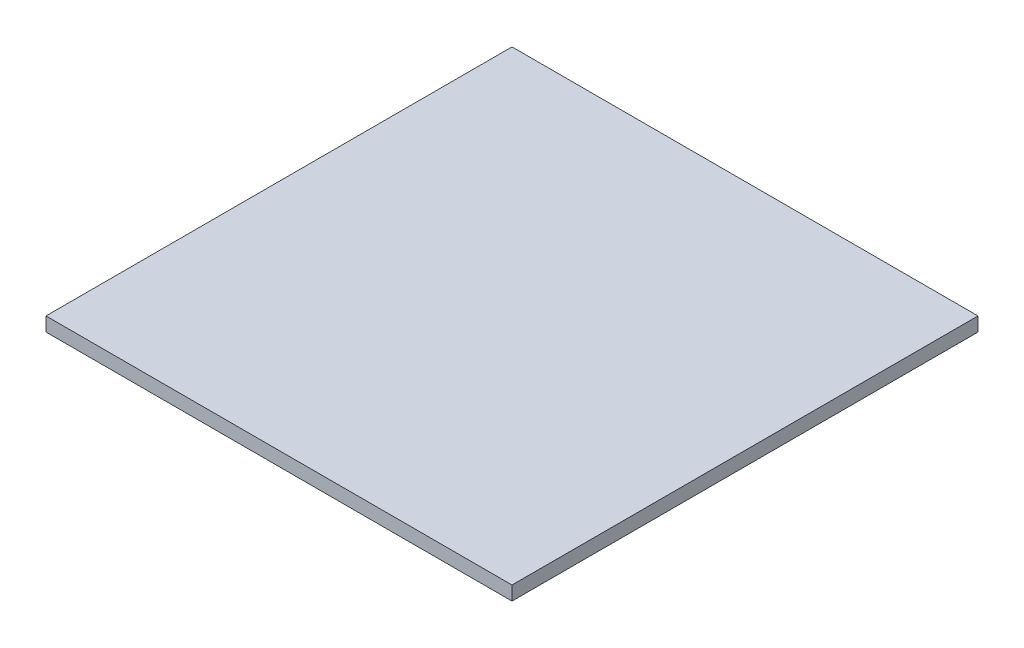
ISO-10303-21;
HEADER;
FILE_DESCRIPTION(('STEP AP214'),'2;1');
FILE_NAME('part.step','',(''),(''),'','','');
FILE_SCHEMA(('AUTOMOTIVE_DESIGN { 1 0 10303 214 1 1 1 1 }'));
ENDSEC;
DATA;
#1=APPLICATION_CONTEXT('core data for automotive mechanical design processes');
#2=APPLICATION_PROTOCOL_DEFINITION('international standard','automotive_design',2000,#1);
#3=PRODUCT_CONTEXT('',#1,'mechanical');
#4=PRODUCT('Part','Part','',(#3));
#5=PRODUCT_RELATED_PRODUCT_CATEGORY('part','',(#4));
#6=PRODUCT_DEFINITION_FORMATION('','',#4);
#7=PRODUCT_DEFINITION_CONTEXT('part definition',#1,'design');
#8=PRODUCT_DEFINITION('design','',#6,#7);
#9=PRODUCT_DEFINITION_SHAPE('','',#8);
#10=(LENGTH_UNIT() NAMED_UNIT(*) SI_UNIT(.MILLI.,.METRE.));
#11=(NAMED_UNIT(*) PLANE_ANGLE_UNIT() SI_UNIT($,.RADIAN.));
#12=(NAMED_UNIT(*) SI_UNIT($,.STERADIAN.) SOLID_ANGLE_UNIT());
#13=UNCERTAINTY_MEASURE_WITH_UNIT(LENGTH_MEASURE(1.E-05),#10,'distance_accuracy_value','');
#14=(GEOMETRIC_REPRESENTATION_CONTEXT(3) GLOBAL_UNCERTAINTY_ASSIGNED_CONTEXT((#13)) GLOBAL_UNIT_ASSIGNED_CONTEXT((#10,
#11,#12)) REPRESENTATION_CONTEXT('',''));
#15=CARTESIAN_POINT('',(0.,0.,0.));
#16=DIRECTION('',(0.,0.,1.));
#17=DIRECTION('',(1.,0.,0.));
#18=AXIS2_PLACEMENT_3D('',#15,#16,#17);
#19=CARTESIAN_POINT('',(0.,6.,0.));
#20=DIRECTION('',(0.,0.,-1.));
#21=DIRECTION('',(-1.,0.,0.));
#22=AXIS2_PLACEMENT_3D('',#19,#20,#21);
#23=PLANE('',#22);
#24=DIRECTION('',(1.,0.,0.));
#25=VECTOR('',#24,1.);
#26=CARTESIAN_POINT('',(0.,0.,0.));
#27=LINE('',#26,#25);
#28=CARTESIAN_POINT('',(0.,0.,0.));
#29=VERTEX_POINT('',#28);
#30=CARTESIAN_POINT('',(200.,0.,0.));
#31=VERTEX_POINT('',#30);
#32=EDGE_CURVE('E107',#29,#31,#27,.T.);
#33=ORIENTED_EDGE('',*,*,#32,.T.);
#34=DIRECTION('',(0.,-1.,0.));
#35=VECTOR('',#34,1.);
#36=CARTESIAN_POINT('',(200.,6.,0.));
#37=LINE('',#36,#35);
#38=CARTESIAN_POINT('',(200.,6.,0.));
#39=VERTEX_POINT('',#38);
#40=EDGE_CURVE('E11',#39,#31,#37,.T.);
#41=ORIENTED_EDGE('',*,*,#40,.F.);
#42=DIRECTION('',(1.,0.,0.));
#43=VECTOR('',#42,1.);
#44=CARTESIAN_POINT('',(0.,6.,0.));
#45=LINE('',#44,#43);
#46=CARTESIAN_POINT('',(0.,6.,0.));
#47=VERTEX_POINT('',#46);
#48=EDGE_CURVE('E91',#47,#39,#45,.T.);
#49=ORIENTED_EDGE('',*,*,#48,.F.);
#50=DIRECTION('',(0.,-1.,0.));
#51=VECTOR('',#50,1.);
#52=CARTESIAN_POINT('',(0.,6.,0.));
#53=LINE('',#52,#51);
#54=EDGE_CURVE('E103',#47,#29,#53,.T.);
#55=ORIENTED_EDGE('',*,*,#54,.T.);
#56=EDGE_LOOP('',(#33,#41,#49,#55));
#57=FACE_BOUND('',#56,.T.);
#58=ADVANCED_FACE('F39',(#57),#23,.F.);
#59=CARTESIAN_POINT('',(200.,6.,0.));
#60=DIRECTION('',(-1.,0.,0.));
#61=DIRECTION('',(0.,0.,1.));
#62=AXIS2_PLACEMENT_3D('',#59,#60,#61);
#63=PLANE('',#62);
#64=DIRECTION('',(0.,0.,-1.));
#65=VECTOR('',#64,1.);
#66=CARTESIAN_POINT('',(200.,0.,0.));
#67=LINE('',#66,#65);
#68=CARTESIAN_POINT('',(200.,0.,-200.));
#69=VERTEX_POINT('',#68);
#70=EDGE_CURVE('E96',#31,#69,#67,.T.);
#71=ORIENTED_EDGE('',*,*,#70,.T.);
#72=DIRECTION('',(0.,-1.,0.));
#73=VECTOR('',#72,1.);
#74=CARTESIAN_POINT('',(200.,6.,-200.));
#75=LINE('',#74,#73);
#76=CARTESIAN_POINT('',(200.,6.,-200.));
#77=VERTEX_POINT('',#76);
#78=EDGE_CURVE('E48',#77,#69,#75,.T.);
#79=ORIENTED_EDGE('',*,*,#78,.F.);
#80=DIRECTION('',(0.,0.,-1.));
#81=VECTOR('',#80,1.);
#82=CARTESIAN_POINT('',(200.,6.,0.));
#83=LINE('',#82,#81);
#84=EDGE_CURVE('E86',#39,#77,#83,.T.);
#85=ORIENTED_EDGE('',*,*,#84,.F.);
#86=ORIENTED_EDGE('',*,*,#40,.T.);
#87=EDGE_LOOP('',(#71,#79,#85,#86));
#88=FACE_BOUND('',#87,.T.);
#89=ADVANCED_FACE('F95',(#88),#63,.F.);
#90=CARTESIAN_POINT('',(200.,6.,-200.));
#91=DIRECTION('',(0.,0.,1.));
#92=DIRECTION('',(1.,0.,0.));
#93=AXIS2_PLACEMENT_3D('',#90,#91,#92);
#94=PLANE('',#93);
#95=DIRECTION('',(-1.,0.,0.));
#96=VECTOR('',#95,1.);
#97=CARTESIAN_POINT('',(200.,0.,-200.));
#98=LINE('',#97,#96);
#99=CARTESIAN_POINT('',(0.,0.,-200.));
#100=VERTEX_POINT('',#99);
#101=EDGE_CURVE('E73',#69,#100,#98,.T.);
#102=ORIENTED_EDGE('',*,*,#101,.T.);
#103=DIRECTION('',(0.,-1.,0.));
#104=VECTOR('',#103,1.);
#105=CARTESIAN_POINT('',(0.,6.,-200.));
#106=LINE('',#105,#104);
#107=CARTESIAN_POINT('',(0.,6.,-200.));
#108=VERTEX_POINT('',#107);
#109=EDGE_CURVE('E98',#108,#100,#106,.T.);
#110=ORIENTED_EDGE('',*,*,#109,.F.);
#111=DIRECTION('',(-1.,0.,0.));
#112=VECTOR('',#111,1.);
#113=CARTESIAN_POINT('',(200.,6.,-200.));
#114=LINE('',#113,#112);
#115=EDGE_CURVE('E89',#77,#108,#114,.T.);
#116=ORIENTED_EDGE('',*,*,#115,.F.);
#117=ORIENTED_EDGE('',*,*,#78,.T.);
#118=EDGE_LOOP('',(#102,#110,#116,#117));
#119=FACE_BOUND('',#118,.T.);
#120=ADVANCED_FACE('F99',(#119),#94,.F.);
#121=CARTESIAN_POINT('',(0.,6.,-200.));
#122=DIRECTION('',(1.,0.,0.));
#123=DIRECTION('',(0.,0.,-1.));
#124=AXIS2_PLACEMENT_3D('',#121,#122,#123);
#125=PLANE('',#124);
#126=DIRECTION('',(0.,0.,1.));
#127=VECTOR('',#126,1.);
#128=CARTESIAN_POINT('',(0.,0.,-200.));
#129=LINE('',#128,#127);
#130=EDGE_CURVE('E79',#100,#29,#129,.T.);
#131=ORIENTED_EDGE('',*,*,#130,.T.);
#132=ORIENTED_EDGE('',*,*,#54,.F.);
#133=DIRECTION('',(0.,0.,1.));
#134=VECTOR('',#133,1.);
#135=CARTESIAN_POINT('',(0.,6.,-200.));
#136=LINE('',#135,#134);
#137=EDGE_CURVE('E56',#108,#47,#136,.T.);
#138=ORIENTED_EDGE('',*,*,#137,.F.);
#139=ORIENTED_EDGE('',*,*,#109,.T.);
#140=EDGE_LOOP('',(#131,#132,#138,#139));
#141=FACE_BOUND('',#140,.T.);
#142=ADVANCED_FACE('F120',(#141),#125,.F.);
#143=CARTESIAN_POINT('',(0.,6.,0.));
#144=DIRECTION('',(0.,1.,0.));
#145=DIRECTION('',(0.,0.,1.));
#146=AXIS2_PLACEMENT_3D('',#143,#144,#145);
#147=PLANE('',#146);
#148=ORIENTED_EDGE('',*,*,#48,.T.);
#149=ORIENTED_EDGE('',*,*,#84,.T.);
#150=ORIENTED_EDGE('',*,*,#115,.T.);
#151=ORIENTED_EDGE('',*,*,#137,.T.);
#152=EDGE_LOOP('',(#148,#149,#150,#151));
#153=FACE_BOUND('',#152,.T.);
#154=ADVANCED_FACE('F87',(#153),#147,.T.);
#155=CARTESIAN_POINT('',(0.,0.,0.));
#156=DIRECTION('',(0.,1.,0.));
#157=DIRECTION('',(0.,0.,1.));
#158=AXIS2_PLACEMENT_3D('',#155,#156,#157);
#159=PLANE('',#158);
#160=ORIENTED_EDGE('',*,*,#32,.F.);
#161=ORIENTED_EDGE('',*,*,#130,.F.);
#162=ORIENTED_EDGE('',*,*,#101,.F.);
#163=ORIENTED_EDGE('',*,*,#70,.F.);
#164=EDGE_LOOP('',(#160,#161,#162,#163));
#165=FACE_BOUND('',#164,.T.);
#166=ADVANCED_FACE('F123',(#165),#159,.F.);
#167=CLOSED_SHELL('',(#58,#89,#120,#142,#154,#166));
#168=MANIFOLD_SOLID_BREP('B2',#167);
#169=ADVANCED_BREP_SHAPE_REPRESENTATION('',(#18,#168),#14);
#170=SHAPE_DEFINITION_REPRESENTATION(#9,#169);
ENDSEC;
END-ISO-10303-21;
